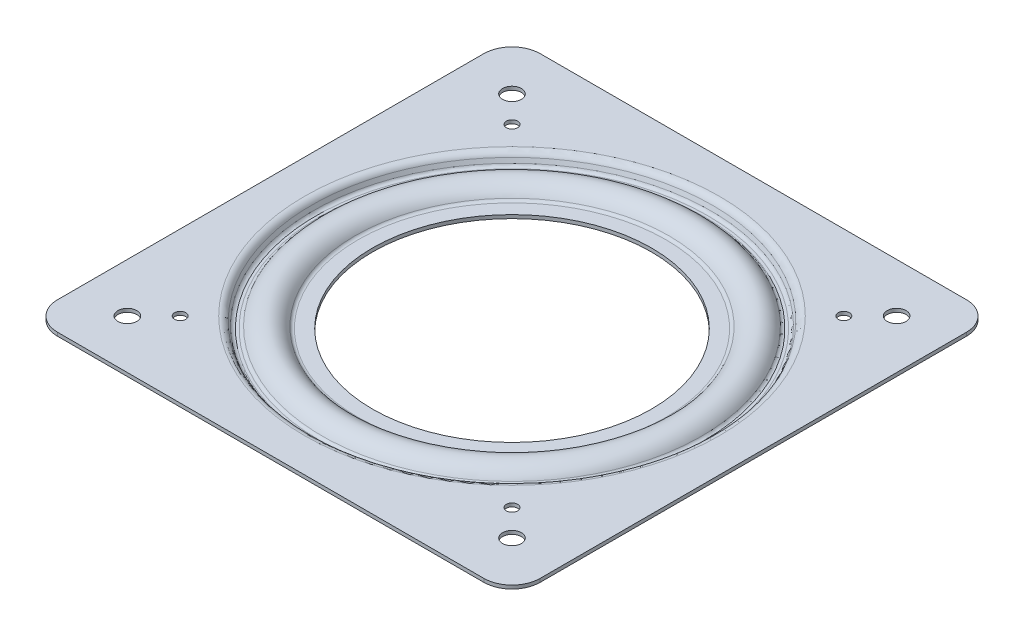
ISO-10303-21;
HEADER;
FILE_DESCRIPTION(('STEP AP214'),'2;1');
FILE_NAME('part.step','',(''),(''),'','','');
FILE_SCHEMA(('AUTOMOTIVE_DESIGN { 1 0 10303 214 1 1 1 1 }'));
ENDSEC;
DATA;
#1=APPLICATION_CONTEXT('core data for automotive mechanical design processes');
#2=APPLICATION_PROTOCOL_DEFINITION('international standard','automotive_design',2000,#1);
#3=PRODUCT_CONTEXT('',#1,'mechanical');
#4=PRODUCT('Part','Part','',(#3));
#5=PRODUCT_RELATED_PRODUCT_CATEGORY('part','',(#4));
#6=PRODUCT_DEFINITION_FORMATION('','',#4);
#7=PRODUCT_DEFINITION_CONTEXT('part definition',#1,'design');
#8=PRODUCT_DEFINITION('design','',#6,#7);
#9=PRODUCT_DEFINITION_SHAPE('','',#8);
#10=(LENGTH_UNIT() NAMED_UNIT(*) SI_UNIT(.MILLI.,.METRE.));
#11=(NAMED_UNIT(*) PLANE_ANGLE_UNIT() SI_UNIT($,.RADIAN.));
#12=(NAMED_UNIT(*) SI_UNIT($,.STERADIAN.) SOLID_ANGLE_UNIT());
#13=UNCERTAINTY_MEASURE_WITH_UNIT(LENGTH_MEASURE(1.E-05),#10,'distance_accuracy_value','');
#14=(GEOMETRIC_REPRESENTATION_CONTEXT(3) GLOBAL_UNCERTAINTY_ASSIGNED_CONTEXT((#13)) GLOBAL_UNIT_ASSIGNED_CONTEXT((#10,
#11,#12)) REPRESENTATION_CONTEXT('',''));
#15=CARTESIAN_POINT('',(0.,0.,0.));
#16=DIRECTION('',(0.,0.,1.));
#17=DIRECTION('',(1.,0.,0.));
#18=AXIS2_PLACEMENT_3D('',#15,#16,#17);
#19=CARTESIAN_POINT('',(29.3751,0.7366,0.));
#20=DIRECTION('',(0.,1.,0.));
#21=DIRECTION('',(0.,0.,1.));
#22=AXIS2_PLACEMENT_3D('',#19,#20,#21);
#23=PLANE('',#22);
#24=CARTESIAN_POINT('',(0.,0.7366,0.));
#25=DIRECTION('',(0.,-1.,0.));
#26=DIRECTION('',(0.,0.,-1.));
#27=AXIS2_PLACEMENT_3D('',#24,#25,#26);
#28=CIRCLE('',#27,32.3948787449548);
#29=CARTESIAN_POINT('',(0.,0.7366,32.3948787449548));
#30=VERTEX_POINT('',#29);
#31=CARTESIAN_POINT('',(0.,0.7366,-32.3948787449548));
#32=VERTEX_POINT('',#31);
#33=EDGE_CURVE('E135',#30,#32,#28,.F.);
#34=ORIENTED_EDGE('',*,*,#33,.T.);
#35=CARTESIAN_POINT('',(0.,0.7366,0.));
#36=DIRECTION('',(0.,-1.,0.));
#37=DIRECTION('',(0.,0.,1.));
#38=AXIS2_PLACEMENT_3D('',#35,#36,#37);
#39=CIRCLE('',#38,32.3948787449548);
#40=EDGE_CURVE('E138',#32,#30,#39,.F.);
#41=ORIENTED_EDGE('',*,*,#40,.T.);
#42=EDGE_LOOP('',(#34,#41));
#43=FACE_BOUND('',#42,.T.);
#44=CARTESIAN_POINT('',(0.,0.7366,0.));
#45=DIRECTION('',(0.,-1.,0.));
#46=DIRECTION('',(0.,0.,-1.));
#47=AXIS2_PLACEMENT_3D('',#44,#45,#46);
#48=CIRCLE('',#47,29.3751);
#49=CARTESIAN_POINT('',(0.,0.7366,-29.3751));
#50=VERTEX_POINT('',#49);
#51=EDGE_CURVE('E148',#50,#50,#48,.T.);
#52=ORIENTED_EDGE('',*,*,#51,.T.);
#53=EDGE_LOOP('',(#52));
#54=FACE_BOUND('',#53,.T.);
#55=ADVANCED_FACE('F15',(#43,#54),#23,.T.);
#56=CARTESIAN_POINT('',(0.,-15.4958338824743,0.));
#57=DIRECTION('',(0.,-1.,0.));
#58=DIRECTION('',(0.,0.,-1.));
#59=AXIS2_PLACEMENT_3D('',#56,#57,#58);
#60=CYLINDRICAL_SURFACE('',#59,29.3751);
#61=CARTESIAN_POINT('',(0.,0.,0.));
#62=DIRECTION('',(0.,-1.,0.));
#63=DIRECTION('',(0.,0.,-1.));
#64=AXIS2_PLACEMENT_3D('',#61,#62,#63);
#65=CIRCLE('',#64,29.3751);
#66=CARTESIAN_POINT('',(0.,0.,-29.3751));
#67=VERTEX_POINT('',#66);
#68=EDGE_CURVE('E143',#67,#67,#65,.F.);
#69=ORIENTED_EDGE('',*,*,#68,.F.);
#70=EDGE_LOOP('',(#69));
#71=FACE_BOUND('',#70,.T.);
#72=ORIENTED_EDGE('',*,*,#51,.F.);
#73=EDGE_LOOP('',(#72));
#74=FACE_BOUND('',#73,.T.);
#75=ADVANCED_FACE('F726',(#71,#74),#60,.F.);
#76=CARTESIAN_POINT('',(0.,1.524,0.));
#77=DIRECTION('',(0.,-1.,0.));
#78=DIRECTION('',(0.,0.,-1.));
#79=AXIS2_PLACEMENT_3D('',#76,#77,#78);
#80=TOROIDAL_SURFACE('',#79,32.3948787449548,0.787400000000001);
#81=ORIENTED_EDGE('',*,*,#40,.F.);
#82=ORIENTED_EDGE('',*,*,#33,.F.);
#83=EDGE_LOOP('',(#81,#82));
#84=FACE_BOUND('',#83,.T.);
#85=CARTESIAN_POINT('',(0.,1.10762617801047,0.));
#86=DIRECTION('',(0.,-1.,0.));
#87=DIRECTION('',(0.,0.,-1.));
#88=AXIS2_PLACEMENT_3D('',#85,#86,#87);
#89=CIRCLE('',#88,33.0631837654072);
#90=CARTESIAN_POINT('',(0.,1.10762617801047,-33.0631837654072));
#91=VERTEX_POINT('',#90);
#92=EDGE_CURVE('E224',#91,#91,#89,.T.);
#93=ORIENTED_EDGE('',*,*,#92,.F.);
#94=EDGE_LOOP('',(#93));
#95=FACE_BOUND('',#94,.T.);
#96=ADVANCED_FACE('F146',(#84,#95),#80,.F.);
#97=CARTESIAN_POINT('',(32.3948787449548,0.,0.));
#98=DIRECTION('',(0.,-1.,0.));
#99=DIRECTION('',(0.,0.,-1.));
#100=AXIS2_PLACEMENT_3D('',#97,#98,#99);
#101=PLANE('',#100);
#102=ORIENTED_EDGE('',*,*,#68,.T.);
#103=EDGE_LOOP('',(#102));
#104=FACE_BOUND('',#103,.T.);
#105=CARTESIAN_POINT('',(0.,0.,0.));
#106=DIRECTION('',(0.,1.,0.));
#107=DIRECTION('',(0.,0.,1.));
#108=AXIS2_PLACEMENT_3D('',#105,#106,#107);
#109=CIRCLE('',#108,32.3948787449548);
#110=CARTESIAN_POINT('',(0.,0.,32.3948787449548));
#111=VERTEX_POINT('',#110);
#112=CARTESIAN_POINT('',(0.,0.,-32.3948787449548));
#113=VERTEX_POINT('',#112);
#114=EDGE_CURVE('E194',#111,#113,#109,.T.);
#115=ORIENTED_EDGE('',*,*,#114,.F.);
#116=CARTESIAN_POINT('',(0.,0.,0.));
#117=DIRECTION('',(0.,1.,0.));
#118=DIRECTION('',(0.,0.,-1.));
#119=AXIS2_PLACEMENT_3D('',#116,#117,#118);
#120=CIRCLE('',#119,32.3948787449548);
#121=EDGE_CURVE('E188',#113,#111,#120,.T.);
#122=ORIENTED_EDGE('',*,*,#121,.F.);
#123=EDGE_LOOP('',(#115,#122));
#124=FACE_BOUND('',#123,.T.);
#125=ADVANCED_FACE('F200',(#104,#124),#101,.T.);
#126=CARTESIAN_POINT('',(0.,-1.0414,0.));
#127=DIRECTION('',(0.,-1.,0.));
#128=DIRECTION('',(0.,0.,-1.));
#129=AXIS2_PLACEMENT_3D('',#126,#127,#128);
#130=TOROIDAL_SURFACE('',#129,36.5125,4.064);
#131=ORIENTED_EDGE('',*,*,#92,.T.);
#132=EDGE_LOOP('',(#131));
#133=FACE_BOUND('',#132,.T.);
#134=CARTESIAN_POINT('',(0.,1.10762617801047,0.));
#135=DIRECTION('',(0.,-1.,0.));
#136=DIRECTION('',(0.,0.,-1.));
#137=AXIS2_PLACEMENT_3D('',#134,#135,#136);
#138=CIRCLE('',#137,39.9618162345928);
#139=CARTESIAN_POINT('',(0.,1.10762617801047,-39.9618162345928));
#140=VERTEX_POINT('',#139);
#141=EDGE_CURVE('E186',#140,#140,#138,.F.);
#142=ORIENTED_EDGE('',*,*,#141,.T.);
#143=EDGE_LOOP('',(#142));
#144=FACE_BOUND('',#143,.T.);
#145=ADVANCED_FACE('F167',(#133,#144),#130,.T.);
#146=CARTESIAN_POINT('',(0.,1.524,0.));
#147=DIRECTION('',(0.,-1.,0.));
#148=DIRECTION('',(0.,0.,-1.));
#149=AXIS2_PLACEMENT_3D('',#146,#147,#148);
#150=TOROIDAL_SURFACE('',#149,32.3948787449548,1.524);
#151=CARTESIAN_POINT('',(0.,0.718115183246069,0.));
#152=DIRECTION('',(0.,-1.,0.));
#153=DIRECTION('',(0.,0.,-1.));
#154=AXIS2_PLACEMENT_3D('',#151,#152,#153);
#155=CIRCLE('',#154,33.6883723329271);
#156=CARTESIAN_POINT('',(0.,0.718115183246069,-33.6883723329271));
#157=VERTEX_POINT('',#156);
#158=EDGE_CURVE('E182',#157,#157,#155,.T.);
#159=ORIENTED_EDGE('',*,*,#158,.T.);
#160=EDGE_LOOP('',(#159));
#161=FACE_BOUND('',#160,.T.);
#162=ORIENTED_EDGE('',*,*,#121,.T.);
#163=ORIENTED_EDGE('',*,*,#114,.T.);
#164=EDGE_LOOP('',(#162,#163));
#165=FACE_BOUND('',#164,.T.);
#166=ADVANCED_FACE('F155',(#161,#165),#150,.T.);
#167=CARTESIAN_POINT('',(0.,1.524,0.));
#168=DIRECTION('',(0.,-1.,0.));
#169=DIRECTION('',(0.,0.,-1.));
#170=AXIS2_PLACEMENT_3D('',#167,#168,#169);
#171=TOROIDAL_SURFACE('',#170,40.6301212550452,0.787400000000001);
#172=ORIENTED_EDGE('',*,*,#141,.F.);
#173=EDGE_LOOP('',(#172));
#174=FACE_BOUND('',#173,.T.);
#175=CARTESIAN_POINT('',(0.,0.736600000000002,0.));
#176=DIRECTION('',(0.,1.,0.));
#177=DIRECTION('',(0.,0.,-1.));
#178=AXIS2_PLACEMENT_3D('',#175,#176,#177);
#179=CIRCLE('',#178,40.6301212550452);
#180=CARTESIAN_POINT('',(0.,0.736600000000002,40.6301212550452));
#181=VERTEX_POINT('',#180);
#182=CARTESIAN_POINT('',(0.,0.736600000000002,-40.6301212550452));
#183=VERTEX_POINT('',#182);
#184=EDGE_CURVE('E487',#181,#183,#179,.F.);
#185=ORIENTED_EDGE('',*,*,#184,.F.);
#186=CARTESIAN_POINT('',(0.,0.736600000000002,0.));
#187=DIRECTION('',(0.,1.,0.));
#188=DIRECTION('',(0.,0.,1.));
#189=AXIS2_PLACEMENT_3D('',#186,#187,#188);
#190=CIRCLE('',#189,40.6301212550452);
#191=EDGE_CURVE('E185',#183,#181,#190,.F.);
#192=ORIENTED_EDGE('',*,*,#191,.F.);
#193=EDGE_LOOP('',(#185,#192));
#194=FACE_BOUND('',#193,.T.);
#195=ADVANCED_FACE('F166',(#174,#194),#171,.F.);
#196=CARTESIAN_POINT('',(0.,-1.0414,0.));
#197=DIRECTION('',(0.,-1.,0.));
#198=DIRECTION('',(0.,0.,-1.));
#199=AXIS2_PLACEMENT_3D('',#196,#197,#198);
#200=TOROIDAL_SURFACE('',#199,36.5125,3.3274);
#201=CARTESIAN_POINT('',(0.,0.718115183246072,0.));
#202=DIRECTION('',(0.,-1.,0.));
#203=DIRECTION('',(0.,0.,-1.));
#204=AXIS2_PLACEMENT_3D('',#201,#202,#203);
#205=CIRCLE('',#204,39.3366276670729);
#206=CARTESIAN_POINT('',(0.,0.718115183246072,-39.3366276670729));
#207=VERTEX_POINT('',#206);
#208=EDGE_CURVE('E485',#207,#207,#205,.F.);
#209=ORIENTED_EDGE('',*,*,#208,.F.);
#210=EDGE_LOOP('',(#209));
#211=FACE_BOUND('',#210,.T.);
#212=ORIENTED_EDGE('',*,*,#158,.F.);
#213=EDGE_LOOP('',(#212));
#214=FACE_BOUND('',#213,.T.);
#215=ADVANCED_FACE('F448',(#211,#214),#200,.F.);
#216=CARTESIAN_POINT('',(41.1799370619112,0.736600000000001,0.));
#217=DIRECTION('',(0.,1.,0.));
#218=DIRECTION('',(0.,0.,1.));
#219=AXIS2_PLACEMENT_3D('',#216,#217,#218);
#220=PLANE('',#219);
#221=CARTESIAN_POINT('',(0.,0.736600000000003,0.));
#222=DIRECTION('',(0.,-1.,0.));
#223=DIRECTION('',(0.,0.,-1.));
#224=AXIS2_PLACEMENT_3D('',#221,#222,#223);
#225=CIRCLE('',#224,41.1799370619112);
#226=CARTESIAN_POINT('',(0.,0.736600000000002,41.1799370619112));
#227=VERTEX_POINT('',#226);
#228=CARTESIAN_POINT('',(0.,0.736600000000002,-41.1799370619112));
#229=VERTEX_POINT('',#228);
#230=EDGE_CURVE('E384',#227,#229,#225,.F.);
#231=ORIENTED_EDGE('',*,*,#230,.T.);
#232=CARTESIAN_POINT('',(0.,0.736600000000003,0.));
#233=DIRECTION('',(0.,-1.,0.));
#234=DIRECTION('',(0.,0.,1.));
#235=AXIS2_PLACEMENT_3D('',#232,#233,#234);
#236=CIRCLE('',#235,41.1799370619112);
#237=EDGE_CURVE('E467',#229,#227,#236,.F.);
#238=ORIENTED_EDGE('',*,*,#237,.T.);
#239=EDGE_LOOP('',(#231,#238));
#240=FACE_BOUND('',#239,.T.);
#241=ORIENTED_EDGE('',*,*,#191,.T.);
#242=ORIENTED_EDGE('',*,*,#184,.T.);
#243=EDGE_LOOP('',(#241,#242));
#244=FACE_BOUND('',#243,.T.);
#245=ADVANCED_FACE('F440',(#240,#244),#220,.T.);
#246=CARTESIAN_POINT('',(0.,1.524,0.));
#247=DIRECTION('',(0.,-1.,0.));
#248=DIRECTION('',(0.,0.,-1.));
#249=AXIS2_PLACEMENT_3D('',#246,#247,#248);
#250=TOROIDAL_SURFACE('',#249,40.6301212550452,1.524);
#251=CARTESIAN_POINT('',(0.,0.,0.));
#252=DIRECTION('',(0.,-1.,0.));
#253=DIRECTION('',(0.,0.,-1.));
#254=AXIS2_PLACEMENT_3D('',#251,#252,#253);
#255=CIRCLE('',#254,40.6301212550452);
#256=CARTESIAN_POINT('',(0.,0.,40.6301212550452));
#257=VERTEX_POINT('',#256);
#258=CARTESIAN_POINT('',(0.,0.,-40.6301212550452));
#259=VERTEX_POINT('',#258);
#260=EDGE_CURVE('E639',#257,#259,#255,.F.);
#261=ORIENTED_EDGE('',*,*,#260,.F.);
#262=CARTESIAN_POINT('',(0.,0.,0.));
#263=DIRECTION('',(0.,-1.,0.));
#264=DIRECTION('',(0.,0.,1.));
#265=AXIS2_PLACEMENT_3D('',#262,#263,#264);
#266=CIRCLE('',#265,40.6301212550452);
#267=EDGE_CURVE('E417',#259,#257,#266,.F.);
#268=ORIENTED_EDGE('',*,*,#267,.F.);
#269=EDGE_LOOP('',(#261,#268));
#270=FACE_BOUND('',#269,.T.);
#271=ORIENTED_EDGE('',*,*,#208,.T.);
#272=EDGE_LOOP('',(#271));
#273=FACE_BOUND('',#272,.T.);
#274=ADVANCED_FACE('F402',(#270,#273),#250,.T.);
#275=CARTESIAN_POINT('',(0.,1.524,0.));
#276=DIRECTION('',(0.,-1.,0.));
#277=DIRECTION('',(0.,0.,-1.));
#278=AXIS2_PLACEMENT_3D('',#275,#276,#277);
#279=TOROIDAL_SURFACE('',#278,41.1799370619112,0.787399999999997);
#280=ORIENTED_EDGE('',*,*,#237,.F.);
#281=ORIENTED_EDGE('',*,*,#230,.F.);
#282=EDGE_LOOP('',(#280,#281));
#283=FACE_BOUND('',#282,.T.);
#284=CARTESIAN_POINT('',(0.,1.22903476834431,0.));
#285=DIRECTION('',(0.,1.,0.));
#286=DIRECTION('',(0.,0.,1.));
#287=AXIS2_PLACEMENT_3D('',#284,#285,#286);
#288=CIRCLE('',#287,41.9100016289971);
#289=CARTESIAN_POINT('',(0.,1.22903476834431,41.9100016289971));
#290=VERTEX_POINT('',#289);
#291=EDGE_CURVE('E415',#290,#290,#288,.T.);
#292=ORIENTED_EDGE('',*,*,#291,.T.);
#293=EDGE_LOOP('',(#292));
#294=FACE_BOUND('',#293,.T.);
#295=ADVANCED_FACE('F390',(#283,#294),#279,.F.);
#296=CARTESIAN_POINT('',(41.1799370619112,0.,0.));
#297=DIRECTION('',(0.,-1.,0.));
#298=DIRECTION('',(0.,0.,-1.));
#299=AXIS2_PLACEMENT_3D('',#296,#297,#298);
#300=PLANE('',#299);
#301=ORIENTED_EDGE('',*,*,#260,.T.);
#302=ORIENTED_EDGE('',*,*,#267,.T.);
#303=EDGE_LOOP('',(#301,#302));
#304=FACE_BOUND('',#303,.T.);
#305=CARTESIAN_POINT('',(0.,0.,0.));
#306=DIRECTION('',(0.,1.,0.));
#307=DIRECTION('',(0.,0.,1.));
#308=AXIS2_PLACEMENT_3D('',#305,#306,#307);
#309=CIRCLE('',#308,41.1799370619112);
#310=CARTESIAN_POINT('',(0.,0.,41.1799370619112));
#311=VERTEX_POINT('',#310);
#312=CARTESIAN_POINT('',(0.,0.,-41.1799370619112));
#313=VERTEX_POINT('',#312);
#314=EDGE_CURVE('E370',#311,#313,#309,.T.);
#315=ORIENTED_EDGE('',*,*,#314,.F.);
#316=CARTESIAN_POINT('',(0.,0.,0.));
#317=DIRECTION('',(0.,1.,0.));
#318=DIRECTION('',(0.,0.,-1.));
#319=AXIS2_PLACEMENT_3D('',#316,#317,#318);
#320=CIRCLE('',#319,41.1799370619112);
#321=EDGE_CURVE('E614',#313,#311,#320,.T.);
#322=ORIENTED_EDGE('',*,*,#321,.F.);
#323=EDGE_LOOP('',(#315,#322));
#324=FACE_BOUND('',#323,.T.);
#325=ADVANCED_FACE('F401',(#304,#324),#300,.T.);
#326=CARTESIAN_POINT('',(0.,2.06950044836586,0.));
#327=DIRECTION('',(0.,1.,0.));
#328=DIRECTION('',(0.,0.,1.));
#329=AXIS2_PLACEMENT_3D('',#326,#327,#328);
#330=CONICAL_SURFACE('',#329,42.2495718056402,0.383972435438766);
#331=CARTESIAN_POINT('',(0.,2.06950044836586,0.));
#332=DIRECTION('',(0.,-1.,0.));
#333=DIRECTION('',(0.,0.,-1.));
#334=AXIS2_PLACEMENT_3D('',#331,#332,#333);
#335=CIRCLE('',#334,42.2495718056402);
#336=CARTESIAN_POINT('',(0.,2.06950044836586,-42.2495718056402));
#337=VERTEX_POINT('',#336);
#338=EDGE_CURVE('E610',#337,#337,#335,.T.);
#339=ORIENTED_EDGE('',*,*,#338,.F.);
#340=EDGE_LOOP('',(#339));
#341=FACE_BOUND('',#340,.T.);
#342=ORIENTED_EDGE('',*,*,#291,.F.);
#343=EDGE_LOOP('',(#342));
#344=FACE_BOUND('',#343,.T.);
#345=ADVANCED_FACE('F657',(#341,#344),#330,.F.);
#346=CARTESIAN_POINT('',(0.,1.524,0.));
#347=DIRECTION('',(0.,-1.,0.));
#348=DIRECTION('',(0.,0.,-1.));
#349=AXIS2_PLACEMENT_3D('',#346,#347,#348);
#350=TOROIDAL_SURFACE('',#349,41.1799370619112,1.524);
#351=CARTESIAN_POINT('',(0.,0.95309955163414,0.));
#352=DIRECTION('',(0.,1.,0.));
#353=DIRECTION('',(0.,0.,1.));
#354=AXIS2_PLACEMENT_3D('',#351,#352,#353);
#355=CIRCLE('',#354,42.592965256271);
#356=CARTESIAN_POINT('',(0.,0.953099551634137,42.592965256271));
#357=VERTEX_POINT('',#356);
#358=EDGE_CURVE('E608',#357,#357,#355,.T.);
#359=ORIENTED_EDGE('',*,*,#358,.F.);
#360=EDGE_LOOP('',(#359));
#361=FACE_BOUND('',#360,.T.);
#362=ORIENTED_EDGE('',*,*,#321,.T.);
#363=ORIENTED_EDGE('',*,*,#314,.T.);
#364=EDGE_LOOP('',(#362,#363));
#365=FACE_BOUND('',#364,.T.);
#366=ADVANCED_FACE('F350',(#361,#365),#350,.T.);
#367=CARTESIAN_POINT('',(0.,1.4986,0.));
#368=DIRECTION('',(0.,-1.,0.));
#369=DIRECTION('',(0.,0.,-1.));
#370=AXIS2_PLACEMENT_3D('',#367,#368,#369);
#371=TOROIDAL_SURFACE('',#370,43.6626,1.524);
#372=ORIENTED_EDGE('',*,*,#338,.T.);
#373=EDGE_LOOP('',(#372));
#374=FACE_BOUND('',#373,.T.);
#375=CARTESIAN_POINT('',(0.,3.0226,0.));
#376=DIRECTION('',(0.,1.,0.));
#377=DIRECTION('',(0.,0.,-1.));
#378=AXIS2_PLACEMENT_3D('',#375,#376,#377);
#379=CIRCLE('',#378,43.6626);
#380=CARTESIAN_POINT('',(0.,3.0226,43.6626));
#381=VERTEX_POINT('',#380);
#382=CARTESIAN_POINT('',(0.,3.0226,-43.6626));
#383=VERTEX_POINT('',#382);
#384=EDGE_CURVE('E95',#381,#383,#379,.F.);
#385=ORIENTED_EDGE('',*,*,#384,.F.);
#386=CARTESIAN_POINT('',(0.,3.0226,0.));
#387=DIRECTION('',(0.,1.,0.));
#388=DIRECTION('',(0.,0.,1.));
#389=AXIS2_PLACEMENT_3D('',#386,#387,#388);
#390=CIRCLE('',#389,43.6626);
#391=EDGE_CURVE('E302',#383,#381,#390,.F.);
#392=ORIENTED_EDGE('',*,*,#391,.F.);
#393=EDGE_LOOP('',(#385,#392));
#394=FACE_BOUND('',#393,.T.);
#395=ADVANCED_FACE('F346',(#374,#394),#371,.T.);
#396=CARTESIAN_POINT('',(0.,1.79356523165569,0.));
#397=DIRECTION('',(0.,1.,0.));
#398=DIRECTION('',(0.,0.,1.));
#399=AXIS2_PLACEMENT_3D('',#396,#397,#398);
#400=CONICAL_SURFACE('',#399,42.9325354329141,0.383972435438758);
#401=ORIENTED_EDGE('',*,*,#358,.T.);
#402=EDGE_LOOP('',(#401));
#403=FACE_BOUND('',#402,.T.);
#404=CARTESIAN_POINT('',(0.,1.79356523165569,0.));
#405=DIRECTION('',(0.,-1.,0.));
#406=DIRECTION('',(0.,0.,-1.));
#407=AXIS2_PLACEMENT_3D('',#404,#405,#406);
#408=CIRCLE('',#407,42.9325354329141);
#409=CARTESIAN_POINT('',(0.,1.79356523165569,-42.9325354329141));
#410=VERTEX_POINT('',#409);
#411=EDGE_CURVE('E299',#410,#410,#408,.T.);
#412=ORIENTED_EDGE('',*,*,#411,.T.);
#413=EDGE_LOOP('',(#412));
#414=FACE_BOUND('',#413,.T.);
#415=ADVANCED_FACE('F319',(#403,#414),#400,.T.);
#416=CARTESIAN_POINT('',(43.6626,3.0226,0.));
#417=DIRECTION('',(0.,1.,0.));
#418=DIRECTION('',(0.,0.,1.));
#419=AXIS2_PLACEMENT_3D('',#416,#417,#418);
#420=PLANE('',#419);
#421=DIRECTION('',(0.,0.,-1.));
#422=VECTOR('',#421,1.);
#423=CARTESIAN_POINT('',(50.8,3.0226,50.8));
#424=LINE('',#423,#422);
#425=CARTESIAN_POINT('',(50.8,3.0226,-44.8564));
#426=VERTEX_POINT('',#425);
#427=CARTESIAN_POINT('',(50.8,3.0226,44.8564));
#428=VERTEX_POINT('',#427);
#429=EDGE_CURVE('E326',#426,#428,#424,.F.);
#430=ORIENTED_EDGE('',*,*,#429,.F.);
#431=CARTESIAN_POINT('',(44.8564,3.0226,-44.8564));
#432=DIRECTION('',(0.,-1.,0.));
#433=DIRECTION('',(0.,0.,-1.));
#434=AXIS2_PLACEMENT_3D('',#431,#432,#433);
#435=CIRCLE('',#434,5.9436);
#436=CARTESIAN_POINT('',(44.8564,3.0226,-50.8));
#437=VERTEX_POINT('',#436);
#438=EDGE_CURVE('E339',#437,#426,#435,.T.);
#439=ORIENTED_EDGE('',*,*,#438,.F.);
#440=DIRECTION('',(-1.,0.,0.));
#441=VECTOR('',#440,1.);
#442=CARTESIAN_POINT('',(-50.8,3.0226,-50.8));
#443=LINE('',#442,#441);
#444=CARTESIAN_POINT('',(-44.8564,3.0226,-50.8));
#445=VERTEX_POINT('',#444);
#446=EDGE_CURVE('E336',#445,#437,#443,.F.);
#447=ORIENTED_EDGE('',*,*,#446,.F.);
#448=CARTESIAN_POINT('',(-44.8564,3.0226,-44.8564));
#449=DIRECTION('',(0.,-1.,0.));
#450=DIRECTION('',(0.,0.,-1.));
#451=AXIS2_PLACEMENT_3D('',#448,#449,#450);
#452=CIRCLE('',#451,5.9436);
#453=CARTESIAN_POINT('',(-50.8,3.0226,-44.8564));
#454=VERTEX_POINT('',#453);
#455=EDGE_CURVE('E87',#454,#445,#452,.T.);
#456=ORIENTED_EDGE('',*,*,#455,.F.);
#457=DIRECTION('',(0.,0.,1.));
#458=VECTOR('',#457,1.);
#459=CARTESIAN_POINT('',(-50.8,3.0226,50.8));
#460=LINE('',#459,#458);
#461=CARTESIAN_POINT('',(-50.8,3.0226,44.8564));
#462=VERTEX_POINT('',#461);
#463=EDGE_CURVE('E297',#462,#454,#460,.F.);
#464=ORIENTED_EDGE('',*,*,#463,.F.);
#465=CARTESIAN_POINT('',(-44.8564,3.0226,44.8564));
#466=DIRECTION('',(0.,-1.,0.));
#467=DIRECTION('',(0.,0.,-1.));
#468=AXIS2_PLACEMENT_3D('',#465,#466,#467);
#469=CIRCLE('',#468,5.9436);
#470=CARTESIAN_POINT('',(-44.8564,3.0226,50.8));
#471=VERTEX_POINT('',#470);
#472=EDGE_CURVE('E295',#471,#462,#469,.T.);
#473=ORIENTED_EDGE('',*,*,#472,.F.);
#474=DIRECTION('',(1.,0.,0.));
#475=VECTOR('',#474,1.);
#476=CARTESIAN_POINT('',(-50.8,3.0226,50.8));
#477=LINE('',#476,#475);
#478=CARTESIAN_POINT('',(44.8564,3.0226,50.8));
#479=VERTEX_POINT('',#478);
#480=EDGE_CURVE('E288',#479,#471,#477,.F.);
#481=ORIENTED_EDGE('',*,*,#480,.F.);
#482=CARTESIAN_POINT('',(44.8564,3.0226,44.8564));
#483=DIRECTION('',(0.,-1.,0.));
#484=DIRECTION('',(0.,0.,-1.));
#485=AXIS2_PLACEMENT_3D('',#482,#483,#484);
#486=CIRCLE('',#485,5.9436);
#487=EDGE_CURVE('E334',#428,#479,#486,.T.);
#488=ORIENTED_EDGE('',*,*,#487,.F.);
#489=EDGE_LOOP('',(#430,#439,#447,#456,#464,#473,#481,#488));
#490=FACE_BOUND('',#489,.T.);
#491=ORIENTED_EDGE('',*,*,#391,.T.);
#492=ORIENTED_EDGE('',*,*,#384,.T.);
#493=EDGE_LOOP('',(#491,#492));
#494=FACE_BOUND('',#493,.T.);
#495=CARTESIAN_POINT('',(-40.4876,3.0226,-40.4876));
#496=DIRECTION('',(0.,1.,0.));
#497=DIRECTION('',(0.,0.,1.));
#498=AXIS2_PLACEMENT_3D('',#495,#496,#497);
#499=CIRCLE('',#498,1.9812);
#500=CARTESIAN_POINT('',(-40.4876,3.0226,-38.5064));
#501=VERTEX_POINT('',#500);
#502=EDGE_CURVE('E343',#501,#501,#499,.F.);
#503=ORIENTED_EDGE('',*,*,#502,.T.);
#504=EDGE_LOOP('',(#503));
#505=FACE_BOUND('',#504,.T.);
#506=CARTESIAN_POINT('',(-40.4876,3.0226,40.4876));
#507=DIRECTION('',(0.,1.,0.));
#508=DIRECTION('',(0.,0.,1.));
#509=AXIS2_PLACEMENT_3D('',#506,#507,#508);
#510=CIRCLE('',#509,1.9812);
#511=CARTESIAN_POINT('',(-40.4876,3.0226,42.4688));
#512=VERTEX_POINT('',#511);
#513=EDGE_CURVE('E587',#512,#512,#510,.F.);
#514=ORIENTED_EDGE('',*,*,#513,.T.);
#515=EDGE_LOOP('',(#514));
#516=FACE_BOUND('',#515,.T.);
#517=CARTESIAN_POINT('',(40.4876,3.0226,-40.4876));
#518=DIRECTION('',(0.,1.,0.));
#519=DIRECTION('',(0.,0.,1.));
#520=AXIS2_PLACEMENT_3D('',#517,#518,#519);
#521=CIRCLE('',#520,1.9812);
#522=CARTESIAN_POINT('',(40.4876,3.0226,-38.5064));
#523=VERTEX_POINT('',#522);
#524=EDGE_CURVE('E590',#523,#523,#521,.F.);
#525=ORIENTED_EDGE('',*,*,#524,.T.);
#526=EDGE_LOOP('',(#525));
#527=FACE_BOUND('',#526,.T.);
#528=CARTESIAN_POINT('',(40.4876,3.0226,40.4876));
#529=DIRECTION('',(0.,1.,0.));
#530=DIRECTION('',(0.,0.,1.));
#531=AXIS2_PLACEMENT_3D('',#528,#529,#530);
#532=CIRCLE('',#531,1.9812);
#533=CARTESIAN_POINT('',(40.4876,3.0226,42.4688));
#534=VERTEX_POINT('',#533);
#535=EDGE_CURVE('E593',#534,#534,#532,.F.);
#536=ORIENTED_EDGE('',*,*,#535,.T.);
#537=EDGE_LOOP('',(#536));
#538=FACE_BOUND('',#537,.T.);
#539=CARTESIAN_POINT('',(34.925,3.0226,34.925));
#540=DIRECTION('',(0.,1.,0.));
#541=DIRECTION('',(0.,0.,1.));
#542=AXIS2_PLACEMENT_3D('',#539,#540,#541);
#543=CIRCLE('',#542,1.1938);
#544=CARTESIAN_POINT('',(34.925,3.0226,36.1188));
#545=VERTEX_POINT('',#544);
#546=EDGE_CURVE('E596',#545,#545,#543,.F.);
#547=ORIENTED_EDGE('',*,*,#546,.T.);
#548=EDGE_LOOP('',(#547));
#549=FACE_BOUND('',#548,.T.);
#550=CARTESIAN_POINT('',(-34.925,3.0226,34.925));
#551=DIRECTION('',(0.,1.,0.));
#552=DIRECTION('',(0.,0.,1.));
#553=AXIS2_PLACEMENT_3D('',#550,#551,#552);
#554=CIRCLE('',#553,1.1938);
#555=CARTESIAN_POINT('',(-34.925,3.0226,36.1188));
#556=VERTEX_POINT('',#555);
#557=EDGE_CURVE('E599',#556,#556,#554,.F.);
#558=ORIENTED_EDGE('',*,*,#557,.T.);
#559=EDGE_LOOP('',(#558));
#560=FACE_BOUND('',#559,.T.);
#561=CARTESIAN_POINT('',(-34.925,3.0226,-34.925));
#562=DIRECTION('',(0.,1.,0.));
#563=DIRECTION('',(0.,0.,1.));
#564=AXIS2_PLACEMENT_3D('',#561,#562,#563);
#565=CIRCLE('',#564,1.1938);
#566=CARTESIAN_POINT('',(-34.925,3.0226,-33.7312));
#567=VERTEX_POINT('',#566);
#568=EDGE_CURVE('E601',#567,#567,#565,.F.);
#569=ORIENTED_EDGE('',*,*,#568,.T.);
#570=EDGE_LOOP('',(#569));
#571=FACE_BOUND('',#570,.T.);
#572=CARTESIAN_POINT('',(34.925,3.0226,-34.925));
#573=DIRECTION('',(0.,1.,0.));
#574=DIRECTION('',(0.,0.,1.));
#575=AXIS2_PLACEMENT_3D('',#572,#573,#574);
#576=CIRCLE('',#575,1.1938);
#577=CARTESIAN_POINT('',(34.925,3.0226,-33.7312));
#578=VERTEX_POINT('',#577);
#579=EDGE_CURVE('E246',#578,#578,#576,.F.);
#580=ORIENTED_EDGE('',*,*,#579,.T.);
#581=EDGE_LOOP('',(#580));
#582=FACE_BOUND('',#581,.T.);
#583=ADVANCED_FACE('F308',(#490,#494,#505,#516,#527,#538,#549,#560,#571,#582),#420,.T.);
#584=CARTESIAN_POINT('',(34.925,0.,-34.925));
#585=DIRECTION('',(0.,1.,0.));
#586=DIRECTION('',(0.,0.,1.));
#587=AXIS2_PLACEMENT_3D('',#584,#585,#586);
#588=CYLINDRICAL_SURFACE('',#587,1.1938);
#589=CARTESIAN_POINT('',(34.925,2.286,-34.925));
#590=DIRECTION('',(0.,1.,0.));
#591=DIRECTION('',(0.,0.,1.));
#592=AXIS2_PLACEMENT_3D('',#589,#590,#591);
#593=CIRCLE('',#592,1.1938);
#594=CARTESIAN_POINT('',(34.925,2.286,-33.7312));
#595=VERTEX_POINT('',#594);
#596=EDGE_CURVE('E574',#595,#595,#593,.T.);
#597=ORIENTED_EDGE('',*,*,#596,.F.);
#598=EDGE_LOOP('',(#597));
#599=FACE_BOUND('',#598,.T.);
#600=ORIENTED_EDGE('',*,*,#579,.F.);
#601=EDGE_LOOP('',(#600));
#602=FACE_BOUND('',#601,.T.);
#603=ADVANCED_FACE('F318',(#599,#602),#588,.F.);
#604=CARTESIAN_POINT('',(-34.925,0.,-34.925));
#605=DIRECTION('',(0.,1.,0.));
#606=DIRECTION('',(0.,0.,1.));
#607=AXIS2_PLACEMENT_3D('',#604,#605,#606);
#608=CYLINDRICAL_SURFACE('',#607,1.1938);
#609=CARTESIAN_POINT('',(-34.925,2.286,-34.925));
#610=DIRECTION('',(0.,1.,0.));
#611=DIRECTION('',(0.,0.,1.));
#612=AXIS2_PLACEMENT_3D('',#609,#610,#611);
#613=CIRCLE('',#612,1.1938);
#614=CARTESIAN_POINT('',(-34.925,2.286,-33.7312));
#615=VERTEX_POINT('',#614);
#616=EDGE_CURVE('E571',#615,#615,#613,.T.);
#617=ORIENTED_EDGE('',*,*,#616,.F.);
#618=EDGE_LOOP('',(#617));
#619=FACE_BOUND('',#618,.T.);
#620=ORIENTED_EDGE('',*,*,#568,.F.);
#621=EDGE_LOOP('',(#620));
#622=FACE_BOUND('',#621,.T.);
#623=ADVANCED_FACE('F792',(#619,#622),#608,.F.);
#624=CARTESIAN_POINT('',(-34.925,0.,34.925));
#625=DIRECTION('',(0.,1.,0.));
#626=DIRECTION('',(0.,0.,1.));
#627=AXIS2_PLACEMENT_3D('',#624,#625,#626);
#628=CYLINDRICAL_SURFACE('',#627,1.1938);
#629=CARTESIAN_POINT('',(-34.925,2.286,34.925));
#630=DIRECTION('',(0.,1.,0.));
#631=DIRECTION('',(0.,0.,1.));
#632=AXIS2_PLACEMENT_3D('',#629,#630,#631);
#633=CIRCLE('',#632,1.1938);
#634=CARTESIAN_POINT('',(-34.925,2.286,36.1188));
#635=VERTEX_POINT('',#634);
#636=EDGE_CURVE('E568',#635,#635,#633,.T.);
#637=ORIENTED_EDGE('',*,*,#636,.F.);
#638=EDGE_LOOP('',(#637));
#639=FACE_BOUND('',#638,.T.);
#640=ORIENTED_EDGE('',*,*,#557,.F.);
#641=EDGE_LOOP('',(#640));
#642=FACE_BOUND('',#641,.T.);
#643=ADVANCED_FACE('F800',(#639,#642),#628,.F.);
#644=CARTESIAN_POINT('',(34.925,0.,34.925));
#645=DIRECTION('',(0.,1.,0.));
#646=DIRECTION('',(0.,0.,1.));
#647=AXIS2_PLACEMENT_3D('',#644,#645,#646);
#648=CYLINDRICAL_SURFACE('',#647,1.1938);
#649=CARTESIAN_POINT('',(34.925,2.286,34.925));
#650=DIRECTION('',(0.,1.,0.));
#651=DIRECTION('',(0.,0.,1.));
#652=AXIS2_PLACEMENT_3D('',#649,#650,#651);
#653=CIRCLE('',#652,1.1938);
#654=CARTESIAN_POINT('',(34.925,2.286,36.1188));
#655=VERTEX_POINT('',#654);
#656=EDGE_CURVE('E565',#655,#655,#653,.T.);
#657=ORIENTED_EDGE('',*,*,#656,.F.);
#658=EDGE_LOOP('',(#657));
#659=FACE_BOUND('',#658,.T.);
#660=ORIENTED_EDGE('',*,*,#546,.F.);
#661=EDGE_LOOP('',(#660));
#662=FACE_BOUND('',#661,.T.);
#663=ADVANCED_FACE('F808',(#659,#662),#648,.F.);
#664=CARTESIAN_POINT('',(40.4876,0.,40.4876));
#665=DIRECTION('',(0.,1.,0.));
#666=DIRECTION('',(0.,0.,1.));
#667=AXIS2_PLACEMENT_3D('',#664,#665,#666);
#668=CYLINDRICAL_SURFACE('',#667,1.9812);
#669=CARTESIAN_POINT('',(40.4876,2.286,40.4876));
#670=DIRECTION('',(0.,1.,0.));
#671=DIRECTION('',(0.,0.,1.));
#672=AXIS2_PLACEMENT_3D('',#669,#670,#671);
#673=CIRCLE('',#672,1.9812);
#674=CARTESIAN_POINT('',(40.4876,2.286,42.4688));
#675=VERTEX_POINT('',#674);
#676=EDGE_CURVE('E562',#675,#675,#673,.T.);
#677=ORIENTED_EDGE('',*,*,#676,.F.);
#678=EDGE_LOOP('',(#677));
#679=FACE_BOUND('',#678,.T.);
#680=ORIENTED_EDGE('',*,*,#535,.F.);
#681=EDGE_LOOP('',(#680));
#682=FACE_BOUND('',#681,.T.);
#683=ADVANCED_FACE('F817',(#679,#682),#668,.F.);
#684=CARTESIAN_POINT('',(40.4876,0.,-40.4876));
#685=DIRECTION('',(0.,1.,0.));
#686=DIRECTION('',(0.,0.,1.));
#687=AXIS2_PLACEMENT_3D('',#684,#685,#686);
#688=CYLINDRICAL_SURFACE('',#687,1.9812);
#689=CARTESIAN_POINT('',(40.4876,2.286,-40.4876));
#690=DIRECTION('',(0.,1.,0.));
#691=DIRECTION('',(0.,0.,1.));
#692=AXIS2_PLACEMENT_3D('',#689,#690,#691);
#693=CIRCLE('',#692,1.9812);
#694=CARTESIAN_POINT('',(40.4876,2.286,-38.5064));
#695=VERTEX_POINT('',#694);
#696=EDGE_CURVE('E555',#695,#695,#693,.T.);
#697=ORIENTED_EDGE('',*,*,#696,.F.);
#698=EDGE_LOOP('',(#697));
#699=FACE_BOUND('',#698,.T.);
#700=ORIENTED_EDGE('',*,*,#524,.F.);
#701=EDGE_LOOP('',(#700));
#702=FACE_BOUND('',#701,.T.);
#703=ADVANCED_FACE('F826',(#699,#702),#688,.F.);
#704=CARTESIAN_POINT('',(-40.4876,0.,40.4876));
#705=DIRECTION('',(0.,1.,0.));
#706=DIRECTION('',(0.,0.,1.));
#707=AXIS2_PLACEMENT_3D('',#704,#705,#706);
#708=CYLINDRICAL_SURFACE('',#707,1.9812);
#709=CARTESIAN_POINT('',(-40.4876,2.286,40.4876));
#710=DIRECTION('',(0.,1.,0.));
#711=DIRECTION('',(0.,0.,1.));
#712=AXIS2_PLACEMENT_3D('',#709,#710,#711);
#713=CIRCLE('',#712,1.9812);
#714=CARTESIAN_POINT('',(-40.4876,2.286,42.4688));
#715=VERTEX_POINT('',#714);
#716=EDGE_CURVE('E551',#715,#715,#713,.T.);
#717=ORIENTED_EDGE('',*,*,#716,.F.);
#718=EDGE_LOOP('',(#717));
#719=FACE_BOUND('',#718,.T.);
#720=ORIENTED_EDGE('',*,*,#513,.F.);
#721=EDGE_LOOP('',(#720));
#722=FACE_BOUND('',#721,.T.);
#723=ADVANCED_FACE('F835',(#719,#722),#708,.F.);
#724=CARTESIAN_POINT('',(-40.4876,0.,-40.4876));
#725=DIRECTION('',(0.,1.,0.));
#726=DIRECTION('',(0.,0.,1.));
#727=AXIS2_PLACEMENT_3D('',#724,#725,#726);
#728=CYLINDRICAL_SURFACE('',#727,1.9812);
#729=CARTESIAN_POINT('',(-40.4876,2.286,-40.4876));
#730=DIRECTION('',(0.,1.,0.));
#731=DIRECTION('',(0.,0.,1.));
#732=AXIS2_PLACEMENT_3D('',#729,#730,#731);
#733=CIRCLE('',#732,1.9812);
#734=CARTESIAN_POINT('',(-40.4876,2.286,-38.5064));
#735=VERTEX_POINT('',#734);
#736=EDGE_CURVE('E549',#735,#735,#733,.T.);
#737=ORIENTED_EDGE('',*,*,#736,.F.);
#738=EDGE_LOOP('',(#737));
#739=FACE_BOUND('',#738,.T.);
#740=ORIENTED_EDGE('',*,*,#502,.F.);
#741=EDGE_LOOP('',(#740));
#742=FACE_BOUND('',#741,.T.);
#743=ADVANCED_FACE('F274',(#739,#742),#728,.F.);
#744=CARTESIAN_POINT('',(0.,1.4986,0.));
#745=DIRECTION('',(0.,-1.,0.));
#746=DIRECTION('',(0.,0.,-1.));
#747=AXIS2_PLACEMENT_3D('',#744,#745,#746);
#748=TOROIDAL_SURFACE('',#747,43.6626,0.787399999999996);
#749=CARTESIAN_POINT('',(0.,2.286,0.));
#750=DIRECTION('',(0.,-1.,0.));
#751=DIRECTION('',(0.,0.,1.));
#752=AXIS2_PLACEMENT_3D('',#749,#750,#751);
#753=CIRCLE('',#752,43.6626);
#754=CARTESIAN_POINT('',(0.,2.286,-43.6626));
#755=VERTEX_POINT('',#754);
#756=CARTESIAN_POINT('',(0.,2.286,43.6626));
#757=VERTEX_POINT('',#756);
#758=EDGE_CURVE('E284',#755,#757,#753,.F.);
#759=ORIENTED_EDGE('',*,*,#758,.F.);
#760=CARTESIAN_POINT('',(0.,2.286,0.));
#761=DIRECTION('',(0.,-1.,0.));
#762=DIRECTION('',(0.,0.,-1.));
#763=AXIS2_PLACEMENT_3D('',#760,#761,#762);
#764=CIRCLE('',#763,43.6626);
#765=EDGE_CURVE('E255',#757,#755,#764,.F.);
#766=ORIENTED_EDGE('',*,*,#765,.F.);
#767=EDGE_LOOP('',(#759,#766));
#768=FACE_BOUND('',#767,.T.);
#769=ORIENTED_EDGE('',*,*,#411,.F.);
#770=EDGE_LOOP('',(#769));
#771=FACE_BOUND('',#770,.T.);
#772=ADVANCED_FACE('F262',(#768,#771),#748,.F.);
#773=CARTESIAN_POINT('',(-50.8,3.0226,50.8));
#774=DIRECTION('',(-1.,0.,0.));
#775=DIRECTION('',(0.,0.,1.));
#776=AXIS2_PLACEMENT_3D('',#773,#774,#775);
#777=PLANE('',#776);
#778=DIRECTION('',(0.,0.,-1.));
#779=VECTOR('',#778,1.);
#780=CARTESIAN_POINT('',(-50.8,2.286,0.));
#781=LINE('',#780,#779);
#782=CARTESIAN_POINT('',(-50.8,2.286,44.8564));
#783=VERTEX_POINT('',#782);
#784=CARTESIAN_POINT('',(-50.8,2.286,-44.8564));
#785=VERTEX_POINT('',#784);
#786=EDGE_CURVE('E545',#783,#785,#781,.T.);
#787=ORIENTED_EDGE('',*,*,#786,.F.);
#788=DIRECTION('',(0.,-1.,0.));
#789=VECTOR('',#788,1.);
#790=CARTESIAN_POINT('',(-50.8,3.0226,44.8564));
#791=LINE('',#790,#789);
#792=EDGE_CURVE('E579',#462,#783,#791,.T.);
#793=ORIENTED_EDGE('',*,*,#792,.F.);
#794=ORIENTED_EDGE('',*,*,#463,.T.);
#795=DIRECTION('',(0.,-1.,0.));
#796=VECTOR('',#795,1.);
#797=CARTESIAN_POINT('',(-50.8,3.0226,-44.8564));
#798=LINE('',#797,#796);
#799=EDGE_CURVE('E282',#785,#454,#798,.F.);
#800=ORIENTED_EDGE('',*,*,#799,.F.);
#801=EDGE_LOOP('',(#787,#793,#794,#800));
#802=FACE_BOUND('',#801,.T.);
#803=ADVANCED_FACE('F273',(#802),#777,.T.);
#804=CARTESIAN_POINT('',(-44.8564,3.0226,-44.8564));
#805=DIRECTION('',(0.,-1.,0.));
#806=DIRECTION('',(0.,0.,-1.));
#807=AXIS2_PLACEMENT_3D('',#804,#805,#806);
#808=CYLINDRICAL_SURFACE('',#807,5.9436);
#809=CARTESIAN_POINT('',(-44.8564,2.286,-44.8564));
#810=DIRECTION('',(0.,-1.,0.));
#811=DIRECTION('',(0.,0.,-1.));
#812=AXIS2_PLACEMENT_3D('',#809,#810,#811);
#813=CIRCLE('',#812,5.9436);
#814=CARTESIAN_POINT('',(-44.8564,2.286,-50.8));
#815=VERTEX_POINT('',#814);
#816=EDGE_CURVE('E547',#785,#815,#813,.T.);
#817=ORIENTED_EDGE('',*,*,#816,.F.);
#818=ORIENTED_EDGE('',*,*,#799,.T.);
#819=ORIENTED_EDGE('',*,*,#455,.T.);
#820=DIRECTION('',(0.,1.,0.));
#821=VECTOR('',#820,1.);
#822=CARTESIAN_POINT('',(-44.8564,3.0226,-50.8));
#823=LINE('',#822,#821);
#824=EDGE_CURVE('E340',#815,#445,#823,.T.);
#825=ORIENTED_EDGE('',*,*,#824,.F.);
#826=EDGE_LOOP('',(#817,#818,#819,#825));
#827=FACE_BOUND('',#826,.T.);
#828=ADVANCED_FACE('F863',(#827),#808,.T.);
#829=CARTESIAN_POINT('',(-50.8,3.0226,-50.8));
#830=DIRECTION('',(0.,0.,-1.));
#831=DIRECTION('',(-1.,0.,0.));
#832=AXIS2_PLACEMENT_3D('',#829,#830,#831);
#833=PLANE('',#832);
#834=ORIENTED_EDGE('',*,*,#446,.T.);
#835=DIRECTION('',(0.,-1.,0.));
#836=VECTOR('',#835,1.);
#837=CARTESIAN_POINT('',(44.8564,3.0226,-50.8));
#838=LINE('',#837,#836);
#839=CARTESIAN_POINT('',(44.8564,2.286,-50.8));
#840=VERTEX_POINT('',#839);
#841=EDGE_CURVE('E583',#840,#437,#838,.F.);
#842=ORIENTED_EDGE('',*,*,#841,.F.);
#843=DIRECTION('',(1.,0.,0.));
#844=VECTOR('',#843,1.);
#845=CARTESIAN_POINT('',(43.6626,2.286,-50.8));
#846=LINE('',#845,#844);
#847=EDGE_CURVE('E987',#815,#840,#846,.T.);
#848=ORIENTED_EDGE('',*,*,#847,.F.);
#849=ORIENTED_EDGE('',*,*,#824,.T.);
#850=EDGE_LOOP('',(#834,#842,#848,#849));
#851=FACE_BOUND('',#850,.T.);
#852=ADVANCED_FACE('F871',(#851),#833,.T.);
#853=CARTESIAN_POINT('',(44.8564,3.0226,-44.8564));
#854=DIRECTION('',(0.,-1.,0.));
#855=DIRECTION('',(0.,0.,-1.));
#856=AXIS2_PLACEMENT_3D('',#853,#854,#855);
#857=CYLINDRICAL_SURFACE('',#856,5.9436);
#858=CARTESIAN_POINT('',(44.8564,2.286,-44.8564));
#859=DIRECTION('',(0.,-1.,0.));
#860=DIRECTION('',(0.,0.,-1.));
#861=AXIS2_PLACEMENT_3D('',#858,#859,#860);
#862=CIRCLE('',#861,5.9436);
#863=CARTESIAN_POINT('',(50.8,2.286,-44.8564));
#864=VERTEX_POINT('',#863);
#865=EDGE_CURVE('E985',#840,#864,#862,.T.);
#866=ORIENTED_EDGE('',*,*,#865,.F.);
#867=ORIENTED_EDGE('',*,*,#841,.T.);
#868=ORIENTED_EDGE('',*,*,#438,.T.);
#869=DIRECTION('',(0.,1.,0.));
#870=VECTOR('',#869,1.);
#871=CARTESIAN_POINT('',(50.8,3.0226,-44.8564));
#872=LINE('',#871,#870);
#873=EDGE_CURVE('E335',#864,#426,#872,.T.);
#874=ORIENTED_EDGE('',*,*,#873,.F.);
#875=EDGE_LOOP('',(#866,#867,#868,#874));
#876=FACE_BOUND('',#875,.T.);
#877=ADVANCED_FACE('F879',(#876),#857,.T.);
#878=CARTESIAN_POINT('',(50.8,3.0226,50.8));
#879=DIRECTION('',(1.,0.,0.));
#880=DIRECTION('',(0.,0.,-1.));
#881=AXIS2_PLACEMENT_3D('',#878,#879,#880);
#882=PLANE('',#881);
#883=ORIENTED_EDGE('',*,*,#429,.T.);
#884=DIRECTION('',(0.,-1.,0.));
#885=VECTOR('',#884,1.);
#886=CARTESIAN_POINT('',(50.8,3.0226,44.8564));
#887=LINE('',#886,#885);
#888=CARTESIAN_POINT('',(50.8,2.286,44.8564));
#889=VERTEX_POINT('',#888);
#890=EDGE_CURVE('E581',#889,#428,#887,.F.);
#891=ORIENTED_EDGE('',*,*,#890,.F.);
#892=DIRECTION('',(0.,0.,-1.));
#893=VECTOR('',#892,1.);
#894=CARTESIAN_POINT('',(50.8,2.286,0.));
#895=LINE('',#894,#893);
#896=EDGE_CURVE('E982',#864,#889,#895,.F.);
#897=ORIENTED_EDGE('',*,*,#896,.F.);
#898=ORIENTED_EDGE('',*,*,#873,.T.);
#899=EDGE_LOOP('',(#883,#891,#897,#898));
#900=FACE_BOUND('',#899,.T.);
#901=ADVANCED_FACE('F888',(#900),#882,.T.);
#902=CARTESIAN_POINT('',(44.8564,3.0226,44.8564));
#903=DIRECTION('',(0.,-1.,0.));
#904=DIRECTION('',(0.,0.,-1.));
#905=AXIS2_PLACEMENT_3D('',#902,#903,#904);
#906=CYLINDRICAL_SURFACE('',#905,5.9436);
#907=CARTESIAN_POINT('',(44.8564,2.286,44.8564));
#908=DIRECTION('',(0.,-1.,0.));
#909=DIRECTION('',(0.,0.,-1.));
#910=AXIS2_PLACEMENT_3D('',#907,#908,#909);
#911=CIRCLE('',#910,5.9436);
#912=CARTESIAN_POINT('',(44.8564,2.286,50.8));
#913=VERTEX_POINT('',#912);
#914=EDGE_CURVE('E991',#889,#913,#911,.T.);
#915=ORIENTED_EDGE('',*,*,#914,.F.);
#916=ORIENTED_EDGE('',*,*,#890,.T.);
#917=ORIENTED_EDGE('',*,*,#487,.T.);
#918=DIRECTION('',(0.,1.,0.));
#919=VECTOR('',#918,1.);
#920=CARTESIAN_POINT('',(44.8564,3.0226,50.8));
#921=LINE('',#920,#919);
#922=EDGE_CURVE('E296',#913,#479,#921,.T.);
#923=ORIENTED_EDGE('',*,*,#922,.F.);
#924=EDGE_LOOP('',(#915,#916,#917,#923));
#925=FACE_BOUND('',#924,.T.);
#926=ADVANCED_FACE('F897',(#925),#906,.T.);
#927=CARTESIAN_POINT('',(-50.8,3.0226,50.8));
#928=DIRECTION('',(0.,0.,1.));
#929=DIRECTION('',(1.,0.,0.));
#930=AXIS2_PLACEMENT_3D('',#927,#928,#929);
#931=PLANE('',#930);
#932=ORIENTED_EDGE('',*,*,#480,.T.);
#933=DIRECTION('',(0.,-1.,0.));
#934=VECTOR('',#933,1.);
#935=CARTESIAN_POINT('',(-44.8564,3.0226,50.8));
#936=LINE('',#935,#934);
#937=CARTESIAN_POINT('',(-44.8564,2.286,50.8));
#938=VERTEX_POINT('',#937);
#939=EDGE_CURVE('E36',#938,#471,#936,.F.);
#940=ORIENTED_EDGE('',*,*,#939,.F.);
#941=DIRECTION('',(1.,0.,0.));
#942=VECTOR('',#941,1.);
#943=CARTESIAN_POINT('',(43.6626,2.286,50.8));
#944=LINE('',#943,#942);
#945=EDGE_CURVE('E27',#913,#938,#944,.F.);
#946=ORIENTED_EDGE('',*,*,#945,.F.);
#947=ORIENTED_EDGE('',*,*,#922,.T.);
#948=EDGE_LOOP('',(#932,#940,#946,#947));
#949=FACE_BOUND('',#948,.T.);
#950=ADVANCED_FACE('F521',(#949),#931,.T.);
#951=CARTESIAN_POINT('',(-44.8564,3.0226,44.8564));
#952=DIRECTION('',(0.,-1.,0.));
#953=DIRECTION('',(0.,0.,-1.));
#954=AXIS2_PLACEMENT_3D('',#951,#952,#953);
#955=CYLINDRICAL_SURFACE('',#954,5.9436);
#956=CARTESIAN_POINT('',(-44.8564,2.286,44.8564));
#957=DIRECTION('',(0.,-1.,0.));
#958=DIRECTION('',(0.,0.,-1.));
#959=AXIS2_PLACEMENT_3D('',#956,#957,#958);
#960=CIRCLE('',#959,5.9436);
#961=EDGE_CURVE('E10',#938,#783,#960,.T.);
#962=ORIENTED_EDGE('',*,*,#961,.F.);
#963=ORIENTED_EDGE('',*,*,#939,.T.);
#964=ORIENTED_EDGE('',*,*,#472,.T.);
#965=ORIENTED_EDGE('',*,*,#792,.T.);
#966=EDGE_LOOP('',(#962,#963,#964,#965));
#967=FACE_BOUND('',#966,.T.);
#968=ADVANCED_FACE('F515',(#967),#955,.T.);
#969=CARTESIAN_POINT('',(43.6626,2.286,0.));
#970=DIRECTION('',(0.,-1.,0.));
#971=DIRECTION('',(0.,0.,-1.));
#972=AXIS2_PLACEMENT_3D('',#969,#970,#971);
#973=PLANE('',#972);
#974=ORIENTED_EDGE('',*,*,#945,.T.);
#975=ORIENTED_EDGE('',*,*,#961,.T.);
#976=ORIENTED_EDGE('',*,*,#786,.T.);
#977=ORIENTED_EDGE('',*,*,#816,.T.);
#978=ORIENTED_EDGE('',*,*,#847,.T.);
#979=ORIENTED_EDGE('',*,*,#865,.T.);
#980=ORIENTED_EDGE('',*,*,#896,.T.);
#981=ORIENTED_EDGE('',*,*,#914,.T.);
#982=EDGE_LOOP('',(#974,#975,#976,#977,#978,#979,#980,#981));
#983=FACE_BOUND('',#982,.T.);
#984=ORIENTED_EDGE('',*,*,#765,.T.);
#985=ORIENTED_EDGE('',*,*,#758,.T.);
#986=EDGE_LOOP('',(#984,#985));
#987=FACE_BOUND('',#986,.T.);
#988=ORIENTED_EDGE('',*,*,#736,.T.);
#989=EDGE_LOOP('',(#988));
#990=FACE_BOUND('',#989,.T.);
#991=ORIENTED_EDGE('',*,*,#716,.T.);
#992=EDGE_LOOP('',(#991));
#993=FACE_BOUND('',#992,.T.);
#994=ORIENTED_EDGE('',*,*,#696,.T.);
#995=EDGE_LOOP('',(#994));
#996=FACE_BOUND('',#995,.T.);
#997=ORIENTED_EDGE('',*,*,#676,.T.);
#998=EDGE_LOOP('',(#997));
#999=FACE_BOUND('',#998,.T.);
#1000=ORIENTED_EDGE('',*,*,#656,.T.);
#1001=EDGE_LOOP('',(#1000));
#1002=FACE_BOUND('',#1001,.T.);
#1003=ORIENTED_EDGE('',*,*,#636,.T.);
#1004=EDGE_LOOP('',(#1003));
#1005=FACE_BOUND('',#1004,.T.);
#1006=ORIENTED_EDGE('',*,*,#616,.T.);
#1007=EDGE_LOOP('',(#1006));
#1008=FACE_BOUND('',#1007,.T.);
#1009=ORIENTED_EDGE('',*,*,#596,.T.);
#1010=EDGE_LOOP('',(#1009));
#1011=FACE_BOUND('',#1010,.T.);
#1012=ADVANCED_FACE('F513',(#983,#987,#990,#993,#996,#999,#1002,#1005,#1008,#1011),#973,.T.);
#1013=CLOSED_SHELL('',(#55,#75,#96,#125,#145,#166,#195,#215,#245,#274,#295,#325,#345,#366,#395,
#415,#583,#603,#623,#643,#663,#683,#703,#723,#743,#772,#803,#828,#852,#877,#901,#926,#950,#968,#1012));
#1014=MANIFOLD_SOLID_BREP('B1',#1013);
#1015=ADVANCED_BREP_SHAPE_REPRESENTATION('',(#18,#1014),#14);
#1016=SHAPE_DEFINITION_REPRESENTATION(#9,#1015);
ENDSEC;
END-ISO-10303-21;
